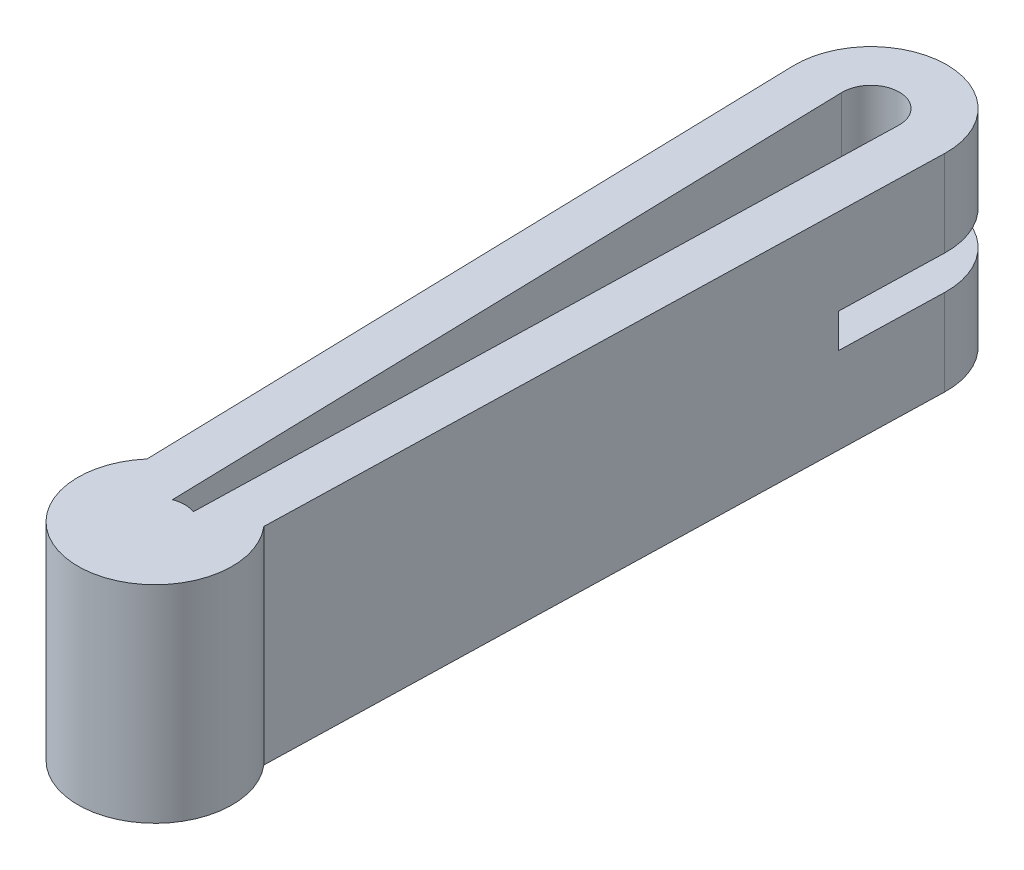
ISO-10303-21;
HEADER;
FILE_DESCRIPTION(('STEP AP214'),'2;1');
FILE_NAME('part.step','',(''),(''),'','','');
FILE_SCHEMA(('AUTOMOTIVE_DESIGN { 1 0 10303 214 1 1 1 1 }'));
ENDSEC;
DATA;
#1=APPLICATION_CONTEXT('core data for automotive mechanical design processes');
#2=APPLICATION_PROTOCOL_DEFINITION('international standard','automotive_design',2000,#1);
#3=PRODUCT_CONTEXT('',#1,'mechanical');
#4=PRODUCT('Part','Part','',(#3));
#5=PRODUCT_RELATED_PRODUCT_CATEGORY('part','',(#4));
#6=PRODUCT_DEFINITION_FORMATION('','',#4);
#7=PRODUCT_DEFINITION_CONTEXT('part definition',#1,'design');
#8=PRODUCT_DEFINITION('design','',#6,#7);
#9=PRODUCT_DEFINITION_SHAPE('','',#8);
#10=(LENGTH_UNIT() NAMED_UNIT(*) SI_UNIT(.MILLI.,.METRE.));
#11=(NAMED_UNIT(*) PLANE_ANGLE_UNIT() SI_UNIT($,.RADIAN.));
#12=(NAMED_UNIT(*) SI_UNIT($,.STERADIAN.) SOLID_ANGLE_UNIT());
#13=UNCERTAINTY_MEASURE_WITH_UNIT(LENGTH_MEASURE(1.E-05),#10,'distance_accuracy_value','');
#14=(GEOMETRIC_REPRESENTATION_CONTEXT(3) GLOBAL_UNCERTAINTY_ASSIGNED_CONTEXT((#13)) GLOBAL_UNIT_ASSIGNED_CONTEXT((#10,
#11,#12)) REPRESENTATION_CONTEXT('',''));
#15=CARTESIAN_POINT('',(0.,0.,0.));
#16=DIRECTION('',(0.,0.,1.));
#17=DIRECTION('',(1.,0.,0.));
#18=AXIS2_PLACEMENT_3D('',#15,#16,#17);
#19=CARTESIAN_POINT('',(0.,0.,14.108957794808));
#20=DIRECTION('',(0.,0.,-1.));
#21=DIRECTION('',(-1.,0.,0.));
#22=AXIS2_PLACEMENT_3D('',#19,#20,#21);
#23=PLANE('',#22);
#24=DIRECTION('',(0.,-1.,0.));
#25=VECTOR('',#24,1.);
#26=CARTESIAN_POINT('',(3.4418499771524,0.,14.108957794808));
#27=LINE('',#26,#25);
#28=CARTESIAN_POINT('',(3.4418499771524,16.129,14.108957794808));
#29=VERTEX_POINT('',#28);
#30=CARTESIAN_POINT('',(3.4418499771524,11.557,14.108957794808));
#31=VERTEX_POINT('',#30);
#32=EDGE_CURVE('E42',#29,#31,#27,.T.);
#33=ORIENTED_EDGE('',*,*,#32,.F.);
#34=DIRECTION('',(1.,0.,0.));
#35=VECTOR('',#34,1.);
#36=CARTESIAN_POINT('',(13.8535163071794,16.129,14.108957794808));
#37=LINE('',#36,#35);
#38=CARTESIAN_POINT('',(9.79402670946941,16.129,14.108957794808));
#39=VERTEX_POINT('',#38);
#40=EDGE_CURVE('E206',#29,#39,#37,.T.);
#41=ORIENTED_EDGE('',*,*,#40,.T.);
#42=DIRECTION('',(0.,1.,0.));
#43=VECTOR('',#42,1.);
#44=CARTESIAN_POINT('',(9.79402670946941,27.686,14.108957794808));
#45=LINE('',#44,#43);
#46=CARTESIAN_POINT('',(9.79402670946941,11.557,14.108957794808));
#47=VERTEX_POINT('',#46);
#48=EDGE_CURVE('E258',#47,#39,#45,.T.);
#49=ORIENTED_EDGE('',*,*,#48,.F.);
#50=DIRECTION('',(-1.,0.,0.));
#51=VECTOR('',#50,1.);
#52=CARTESIAN_POINT('',(13.8535163071794,11.557,14.108957794808));
#53=LINE('',#52,#51);
#54=EDGE_CURVE('E203',#47,#31,#53,.T.);
#55=ORIENTED_EDGE('',*,*,#54,.T.);
#56=EDGE_LOOP('',(#33,#41,#49,#55));
#57=FACE_BOUND('',#56,.T.);
#58=ADVANCED_FACE('F34',(#57),#23,.T.);
#59=CARTESIAN_POINT('',(0.,27.686,0.));
#60=DIRECTION('',(0.,-1.,0.));
#61=DIRECTION('',(0.,0.,-1.));
#62=AXIS2_PLACEMENT_3D('',#59,#60,#61);
#63=CYLINDRICAL_SURFACE('',#62,10.16);
#64=DIRECTION('',(0.,-1.,0.));
#65=VECTOR('',#64,1.);
#66=CARTESIAN_POINT('',(10.1565184217517,27.686,0.265957794807991));
#67=LINE('',#66,#65);
#68=CARTESIAN_POINT('',(10.1565184217517,27.686,0.265957794807991));
#69=VERTEX_POINT('',#68);
#70=CARTESIAN_POINT('',(10.1565184217517,16.129,0.265957794807991));
#71=VERTEX_POINT('',#70);
#72=EDGE_CURVE('E246',#69,#71,#67,.T.);
#73=ORIENTED_EDGE('',*,*,#72,.T.);
#74=CARTESIAN_POINT('',(0.,16.129,0.));
#75=DIRECTION('',(0.,1.,0.));
#76=DIRECTION('',(0.,0.,1.));
#77=AXIS2_PLACEMENT_3D('',#74,#75,#76);
#78=CIRCLE('',#77,10.16);
#79=CARTESIAN_POINT('',(-10.1565184217517,16.129,0.265957794807996));
#80=VERTEX_POINT('',#79);
#81=EDGE_CURVE('E218',#71,#80,#78,.T.);
#82=ORIENTED_EDGE('',*,*,#81,.T.);
#83=DIRECTION('',(0.,-1.,0.));
#84=VECTOR('',#83,1.);
#85=CARTESIAN_POINT('',(-10.1565184217517,27.686,0.265957794807996));
#86=LINE('',#85,#84);
#87=CARTESIAN_POINT('',(-10.1565184217517,27.686,0.265957794807996));
#88=VERTEX_POINT('',#87);
#89=EDGE_CURVE('E255',#88,#80,#86,.T.);
#90=ORIENTED_EDGE('',*,*,#89,.F.);
#91=CARTESIAN_POINT('',(0.,27.686,0.));
#92=DIRECTION('',(0.,1.,0.));
#93=DIRECTION('',(0.,0.,1.));
#94=AXIS2_PLACEMENT_3D('',#91,#92,#93);
#95=CIRCLE('',#94,10.16);
#96=EDGE_CURVE('E225',#69,#88,#95,.T.);
#97=ORIENTED_EDGE('',*,*,#96,.F.);
#98=EDGE_LOOP('',(#73,#82,#90,#97));
#99=FACE_BOUND('',#98,.T.);
#100=ADVANCED_FACE('F302',(#99),#63,.T.);
#101=CARTESIAN_POINT('',(-10.1565184217517,11.557,0.265957794807996));
#102=VERTEX_POINT('',#101);
#103=CARTESIAN_POINT('',(-10.1565184217517,0.,0.265957794807996));
#104=VERTEX_POINT('',#103);
#105=EDGE_CURVE('E254',#102,#104,#86,.T.);
#106=ORIENTED_EDGE('',*,*,#105,.F.);
#107=CARTESIAN_POINT('',(0.,11.557,0.));
#108=DIRECTION('',(0.,-1.,0.));
#109=DIRECTION('',(0.,0.,-1.));
#110=AXIS2_PLACEMENT_3D('',#107,#108,#109);
#111=CIRCLE('',#110,10.16);
#112=CARTESIAN_POINT('',(10.1565184217517,11.557,0.265957794807991));
#113=VERTEX_POINT('',#112);
#114=EDGE_CURVE('E212',#102,#113,#111,.T.);
#115=ORIENTED_EDGE('',*,*,#114,.T.);
#116=CARTESIAN_POINT('',(10.1565184217517,0.,0.265957794807991));
#117=VERTEX_POINT('',#116);
#118=EDGE_CURVE('E236',#113,#117,#67,.T.);
#119=ORIENTED_EDGE('',*,*,#118,.T.);
#120=CARTESIAN_POINT('',(0.,0.,0.));
#121=DIRECTION('',(0.,1.,0.));
#122=DIRECTION('',(0.,0.,1.));
#123=AXIS2_PLACEMENT_3D('',#120,#121,#122);
#124=CIRCLE('',#123,10.16);
#125=EDGE_CURVE('E224',#117,#104,#124,.T.);
#126=ORIENTED_EDGE('',*,*,#125,.T.);
#127=EDGE_LOOP('',(#106,#115,#119,#126));
#128=FACE_BOUND('',#127,.T.);
#129=ADVANCED_FACE('F36',(#128),#63,.T.);
#130=CARTESIAN_POINT('',(-10.1565184217517,27.686,0.265957794807996));
#131=DIRECTION('',(0.999657324975557,0.,-0.0261769483078737));
#132=DIRECTION('',(-0.0261769483078737,0.,-0.999657324975557));
#133=AXIS2_PLACEMENT_3D('',#130,#131,#132);
#134=PLANE('',#133);
#135=ORIENTED_EDGE('',*,*,#89,.T.);
#136=DIRECTION('',(0.0261769483078737,0.,0.999657324975557));
#137=VECTOR('',#136,1.);
#138=CARTESIAN_POINT('',(-10.1565184217517,16.129,0.265957794807996));
#139=LINE('',#138,#137);
#140=CARTESIAN_POINT('',(-9.79402670946939,16.129,14.108957794808));
#141=VERTEX_POINT('',#140);
#142=EDGE_CURVE('E221',#80,#141,#139,.T.);
#143=ORIENTED_EDGE('',*,*,#142,.T.);
#144=DIRECTION('',(0.,1.,0.));
#145=VECTOR('',#144,1.);
#146=CARTESIAN_POINT('',(-9.7940267094694,27.686,14.108957794808));
#147=LINE('',#146,#145);
#148=CARTESIAN_POINT('',(-9.79402670946939,11.557,14.108957794808));
#149=VERTEX_POINT('',#148);
#150=EDGE_CURVE('E210',#149,#141,#147,.T.);
#151=ORIENTED_EDGE('',*,*,#150,.F.);
#152=DIRECTION('',(-0.0261769483078737,0.,-0.999657324975557));
#153=VECTOR('',#152,1.);
#154=CARTESIAN_POINT('',(-10.1565184217517,11.557,0.265957794807996));
#155=LINE('',#154,#153);
#156=EDGE_CURVE('E215',#149,#102,#155,.T.);
#157=ORIENTED_EDGE('',*,*,#156,.T.);
#158=ORIENTED_EDGE('',*,*,#105,.T.);
#159=DIRECTION('',(0.0261769483078737,0.,0.999657324975557));
#160=VECTOR('',#159,1.);
#161=CARTESIAN_POINT('',(-10.1565184217517,0.,0.265957794807996));
#162=LINE('',#161,#160);
#163=CARTESIAN_POINT('',(-7.8285899942509,0.,89.165957794808));
#164=VERTEX_POINT('',#163);
#165=EDGE_CURVE('E239',#104,#164,#162,.T.);
#166=ORIENTED_EDGE('',*,*,#165,.T.);
#167=DIRECTION('',(0.,-1.,0.));
#168=VECTOR('',#167,1.);
#169=CARTESIAN_POINT('',(-7.8285899942509,27.686,89.165957794808));
#170=LINE('',#169,#168);
#171=CARTESIAN_POINT('',(-7.8285899942509,27.686,89.165957794808));
#172=VERTEX_POINT('',#171);
#173=EDGE_CURVE('E251',#172,#164,#170,.T.);
#174=ORIENTED_EDGE('',*,*,#173,.F.);
#175=DIRECTION('',(0.0261769483078737,0.,0.999657324975557));
#176=VECTOR('',#175,1.);
#177=CARTESIAN_POINT('',(-10.1565184217517,27.686,0.265957794807996));
#178=LINE('',#177,#176);
#179=EDGE_CURVE('E228',#88,#172,#178,.T.);
#180=ORIENTED_EDGE('',*,*,#179,.F.);
#181=EDGE_LOOP('',(#135,#143,#151,#157,#158,#166,#174,#180));
#182=FACE_BOUND('',#181,.T.);
#183=ADVANCED_FACE('F288',(#182),#134,.F.);
#184=CARTESIAN_POINT('',(0.,27.686,95.9115488930455));
#185=DIRECTION('',(0.,-1.,0.));
#186=DIRECTION('',(0.,0.,-1.));
#187=AXIS2_PLACEMENT_3D('',#184,#185,#186);
#188=CYLINDRICAL_SURFACE('',#187,10.3339160323039);
#189=CARTESIAN_POINT('',(0.,0.,95.9115488930455));
#190=DIRECTION('',(0.,1.,0.));
#191=DIRECTION('',(0.,0.,1.));
#192=AXIS2_PLACEMENT_3D('',#189,#190,#191);
#193=CIRCLE('',#192,10.3339160323039);
#194=CARTESIAN_POINT('',(7.82858999425095,0.,89.165957794808));
#195=VERTEX_POINT('',#194);
#196=EDGE_CURVE('E241',#164,#195,#193,.T.);
#197=ORIENTED_EDGE('',*,*,#196,.T.);
#198=DIRECTION('',(0.,-1.,0.));
#199=VECTOR('',#198,1.);
#200=CARTESIAN_POINT('',(7.82858999425095,27.686,89.165957794808));
#201=LINE('',#200,#199);
#202=CARTESIAN_POINT('',(7.82858999425095,27.686,89.165957794808));
#203=VERTEX_POINT('',#202);
#204=EDGE_CURVE('E249',#203,#195,#201,.T.);
#205=ORIENTED_EDGE('',*,*,#204,.F.);
#206=CARTESIAN_POINT('',(0.,27.686,95.9115488930455));
#207=DIRECTION('',(0.,1.,0.));
#208=DIRECTION('',(0.,0.,1.));
#209=AXIS2_PLACEMENT_3D('',#206,#207,#208);
#210=CIRCLE('',#209,10.3339160323039);
#211=EDGE_CURVE('E231',#172,#203,#210,.T.);
#212=ORIENTED_EDGE('',*,*,#211,.F.);
#213=ORIENTED_EDGE('',*,*,#173,.T.);
#214=EDGE_LOOP('',(#197,#205,#212,#213));
#215=FACE_BOUND('',#214,.T.);
#216=ADVANCED_FACE('F296',(#215),#188,.T.);
#217=CARTESIAN_POINT('',(10.1565184217517,27.686,0.265957794807991));
#218=DIRECTION('',(0.999657324975557,0.,0.0261769483078731));
#219=DIRECTION('',(0.0261769483078731,0.,-0.999657324975557));
#220=AXIS2_PLACEMENT_3D('',#217,#218,#219);
#221=PLANE('',#220);
#222=DIRECTION('',(-0.0261769483078731,0.,0.999657324975557));
#223=VECTOR('',#222,1.);
#224=CARTESIAN_POINT('',(10.1565184217517,16.129,0.265957794807991));
#225=LINE('',#224,#223);
#226=EDGE_CURVE('E263',#71,#39,#225,.T.);
#227=ORIENTED_EDGE('',*,*,#226,.F.);
#228=ORIENTED_EDGE('',*,*,#72,.F.);
#229=DIRECTION('',(-0.0261769483078731,0.,0.999657324975557));
#230=VECTOR('',#229,1.);
#231=CARTESIAN_POINT('',(10.1565184217517,27.686,0.265957794807991));
#232=LINE('',#231,#230);
#233=EDGE_CURVE('E233',#69,#203,#232,.T.);
#234=ORIENTED_EDGE('',*,*,#233,.T.);
#235=ORIENTED_EDGE('',*,*,#204,.T.);
#236=DIRECTION('',(-0.0261769483078731,0.,0.999657324975557));
#237=VECTOR('',#236,1.);
#238=CARTESIAN_POINT('',(10.1565184217517,0.,0.265957794807991));
#239=LINE('',#238,#237);
#240=EDGE_CURVE('E229',#117,#195,#239,.T.);
#241=ORIENTED_EDGE('',*,*,#240,.F.);
#242=ORIENTED_EDGE('',*,*,#118,.F.);
#243=DIRECTION('',(0.0261769483078731,0.,-0.999657324975557));
#244=VECTOR('',#243,1.);
#245=CARTESIAN_POINT('',(10.1565184217517,11.557,0.265957794807991));
#246=LINE('',#245,#244);
#247=EDGE_CURVE('E261',#47,#113,#246,.T.);
#248=ORIENTED_EDGE('',*,*,#247,.F.);
#249=ORIENTED_EDGE('',*,*,#48,.T.);
#250=EDGE_LOOP('',(#227,#228,#234,#235,#241,#242,#248,#249));
#251=FACE_BOUND('',#250,.T.);
#252=ADVANCED_FACE('F279',(#251),#221,.T.);
#253=CARTESIAN_POINT('',(0.,27.686,0.));
#254=DIRECTION('',(0.,1.,0.));
#255=DIRECTION('',(0.,0.,1.));
#256=AXIS2_PLACEMENT_3D('',#253,#254,#255);
#257=PLANE('',#256);
#258=CARTESIAN_POINT('',(0.,27.686,95.9115488930455));
#259=DIRECTION('',(0.,1.,0.));
#260=DIRECTION('',(0.,0.,-1.));
#261=AXIS2_PLACEMENT_3D('',#258,#259,#260);
#262=CIRCLE('',#261,3.98391603230388);
#263=CARTESIAN_POINT('',(1.39746748710064,27.686,92.1807753037018));
#264=VERTEX_POINT('',#263);
#265=CARTESIAN_POINT('',(-1.39746748710058,27.686,92.1807753037018));
#266=VERTEX_POINT('',#265);
#267=EDGE_CURVE('E150',#264,#266,#262,.T.);
#268=ORIENTED_EDGE('',*,*,#267,.T.);
#269=DIRECTION('',(-0.0261769483078737,0.,-0.999657324975557));
#270=VECTOR('',#269,1.);
#271=CARTESIAN_POINT('',(-1.39746748710058,27.686,92.1807753037018));
#272=LINE('',#271,#270);
#273=CARTESIAN_POINT('',(-3.80869440815687,27.686,0.0997341730529965));
#274=VERTEX_POINT('',#273);
#275=EDGE_CURVE('E159',#266,#274,#272,.T.);
#276=ORIENTED_EDGE('',*,*,#275,.T.);
#277=CARTESIAN_POINT('',(0.,27.686,0.));
#278=DIRECTION('',(0.,-1.,0.));
#279=DIRECTION('',(0.,0.,-1.));
#280=AXIS2_PLACEMENT_3D('',#277,#278,#279);
#281=CIRCLE('',#280,3.81);
#282=CARTESIAN_POINT('',(3.80869440815687,27.686,0.0997341730529971));
#283=VERTEX_POINT('',#282);
#284=EDGE_CURVE('E49',#274,#283,#281,.T.);
#285=ORIENTED_EDGE('',*,*,#284,.T.);
#286=DIRECTION('',(-0.0261769483078731,0.,0.999657324975557));
#287=VECTOR('',#286,1.);
#288=CARTESIAN_POINT('',(3.80869440815687,27.686,0.0997341730529964));
#289=LINE('',#288,#287);
#290=EDGE_CURVE('E156',#283,#264,#289,.T.);
#291=ORIENTED_EDGE('',*,*,#290,.T.);
#292=EDGE_LOOP('',(#268,#276,#285,#291));
#293=FACE_BOUND('',#292,.T.);
#294=ORIENTED_EDGE('',*,*,#96,.T.);
#295=ORIENTED_EDGE('',*,*,#179,.T.);
#296=ORIENTED_EDGE('',*,*,#211,.T.);
#297=ORIENTED_EDGE('',*,*,#233,.F.);
#298=EDGE_LOOP('',(#294,#295,#296,#297));
#299=FACE_BOUND('',#298,.T.);
#300=ADVANCED_FACE('F164',(#293,#299),#257,.T.);
#301=CARTESIAN_POINT('',(0.,0.,0.));
#302=DIRECTION('',(0.,1.,0.));
#303=DIRECTION('',(0.,0.,1.));
#304=AXIS2_PLACEMENT_3D('',#301,#302,#303);
#305=PLANE('',#304);
#306=DIRECTION('',(-0.0261769483078737,0.,-0.999657324975557));
#307=VECTOR('',#306,1.);
#308=CARTESIAN_POINT('',(-1.39746748710058,0.,92.1807753037018));
#309=LINE('',#308,#307);
#310=CARTESIAN_POINT('',(-1.39746748710058,0.,92.1807753037018));
#311=VERTEX_POINT('',#310);
#312=CARTESIAN_POINT('',(-3.80869440815687,0.,0.0997341730529965));
#313=VERTEX_POINT('',#312);
#314=EDGE_CURVE('E176',#311,#313,#309,.T.);
#315=ORIENTED_EDGE('',*,*,#314,.F.);
#316=CARTESIAN_POINT('',(0.,0.,95.9115488930455));
#317=DIRECTION('',(0.,1.,0.));
#318=DIRECTION('',(0.,0.,-1.));
#319=AXIS2_PLACEMENT_3D('',#316,#317,#318);
#320=CIRCLE('',#319,3.98391603230388);
#321=CARTESIAN_POINT('',(1.39746748710064,0.,92.1807753037018));
#322=VERTEX_POINT('',#321);
#323=EDGE_CURVE('E57',#322,#311,#320,.T.);
#324=ORIENTED_EDGE('',*,*,#323,.F.);
#325=DIRECTION('',(-0.0261769483078731,0.,0.999657324975557));
#326=VECTOR('',#325,1.);
#327=CARTESIAN_POINT('',(3.80869440815687,0.,0.0997341730529964));
#328=LINE('',#327,#326);
#329=CARTESIAN_POINT('',(3.80869440815687,0.,0.0997341730529971));
#330=VERTEX_POINT('',#329);
#331=EDGE_CURVE('E167',#330,#322,#328,.T.);
#332=ORIENTED_EDGE('',*,*,#331,.F.);
#333=CARTESIAN_POINT('',(0.,0.,0.));
#334=DIRECTION('',(0.,-1.,0.));
#335=DIRECTION('',(0.,0.,-1.));
#336=AXIS2_PLACEMENT_3D('',#333,#334,#335);
#337=CIRCLE('',#336,3.81);
#338=EDGE_CURVE('E170',#313,#330,#337,.T.);
#339=ORIENTED_EDGE('',*,*,#338,.F.);
#340=EDGE_LOOP('',(#315,#324,#332,#339));
#341=FACE_BOUND('',#340,.T.);
#342=ORIENTED_EDGE('',*,*,#125,.F.);
#343=ORIENTED_EDGE('',*,*,#240,.T.);
#344=ORIENTED_EDGE('',*,*,#196,.F.);
#345=ORIENTED_EDGE('',*,*,#165,.F.);
#346=EDGE_LOOP('',(#342,#343,#344,#345));
#347=FACE_BOUND('',#346,.T.);
#348=ADVANCED_FACE('F293',(#341,#347),#305,.F.);
#349=CARTESIAN_POINT('',(13.8535163071794,16.129,14.108957794808));
#350=DIRECTION('',(0.,1.,0.));
#351=DIRECTION('',(0.,0.,1.));
#352=AXIS2_PLACEMENT_3D('',#349,#350,#351);
#353=PLANE('',#352);
#354=ORIENTED_EDGE('',*,*,#40,.F.);
#355=DIRECTION('',(0.0261769483078731,0.,-0.999657324975557));
#356=VECTOR('',#355,1.);
#357=CARTESIAN_POINT('',(3.44898439057854,16.129,13.8365055380758));
#358=LINE('',#357,#356);
#359=CARTESIAN_POINT('',(3.80869440815687,16.129,0.0997341730529971));
#360=VERTEX_POINT('',#359);
#361=EDGE_CURVE('E196',#29,#360,#358,.T.);
#362=ORIENTED_EDGE('',*,*,#361,.T.);
#363=CARTESIAN_POINT('',(0.,16.129,0.));
#364=DIRECTION('',(0.,1.,0.));
#365=DIRECTION('',(0.,0.,1.));
#366=AXIS2_PLACEMENT_3D('',#363,#364,#365);
#367=CIRCLE('',#366,3.81);
#368=CARTESIAN_POINT('',(-3.80869440815687,16.129,0.0997341730529965));
#369=VERTEX_POINT('',#368);
#370=EDGE_CURVE('E199',#360,#369,#367,.T.);
#371=ORIENTED_EDGE('',*,*,#370,.T.);
#372=DIRECTION('',(0.0261769483078737,0.,0.999657324975557));
#373=VECTOR('',#372,1.);
#374=CARTESIAN_POINT('',(-3.42999862795259,16.129,14.5615425613392));
#375=LINE('',#374,#373);
#376=CARTESIAN_POINT('',(-3.44184997715239,16.129,14.108957794808));
#377=VERTEX_POINT('',#376);
#378=EDGE_CURVE('E190',#369,#377,#375,.T.);
#379=ORIENTED_EDGE('',*,*,#378,.T.);
#380=EDGE_CURVE('E207',#141,#377,#37,.T.);
#381=ORIENTED_EDGE('',*,*,#380,.F.);
#382=ORIENTED_EDGE('',*,*,#142,.F.);
#383=ORIENTED_EDGE('',*,*,#81,.F.);
#384=ORIENTED_EDGE('',*,*,#226,.T.);
#385=EDGE_LOOP('',(#354,#362,#371,#379,#381,#382,#383,#384));
#386=FACE_BOUND('',#385,.T.);
#387=ADVANCED_FACE('F304',(#386),#353,.F.);
#388=CARTESIAN_POINT('',(13.8535163071794,11.557,14.108957794808));
#389=DIRECTION('',(0.,-1.,0.));
#390=DIRECTION('',(0.,0.,-1.));
#391=AXIS2_PLACEMENT_3D('',#388,#389,#390);
#392=PLANE('',#391);
#393=CARTESIAN_POINT('',(0.,11.557,0.));
#394=DIRECTION('',(0.,-1.,0.));
#395=DIRECTION('',(0.,0.,-1.));
#396=AXIS2_PLACEMENT_3D('',#393,#394,#395);
#397=CIRCLE('',#396,3.81);
#398=CARTESIAN_POINT('',(-3.80869440815687,11.557,0.0997341730529965));
#399=VERTEX_POINT('',#398);
#400=CARTESIAN_POINT('',(3.80869440815687,11.557,0.0997341730529971));
#401=VERTEX_POINT('',#400);
#402=EDGE_CURVE('E12',#399,#401,#397,.T.);
#403=ORIENTED_EDGE('',*,*,#402,.T.);
#404=DIRECTION('',(-0.0261769483078731,0.,0.999657324975557));
#405=VECTOR('',#404,1.);
#406=CARTESIAN_POINT('',(3.44898439057854,11.557,13.8365055380758));
#407=LINE('',#406,#405);
#408=EDGE_CURVE('E193',#401,#31,#407,.T.);
#409=ORIENTED_EDGE('',*,*,#408,.T.);
#410=ORIENTED_EDGE('',*,*,#54,.F.);
#411=ORIENTED_EDGE('',*,*,#247,.T.);
#412=ORIENTED_EDGE('',*,*,#114,.F.);
#413=ORIENTED_EDGE('',*,*,#156,.F.);
#414=CARTESIAN_POINT('',(-3.44184997715238,11.557,14.108957794808));
#415=VERTEX_POINT('',#414);
#416=EDGE_CURVE('E202',#415,#149,#53,.T.);
#417=ORIENTED_EDGE('',*,*,#416,.F.);
#418=DIRECTION('',(-0.0261769483078737,0.,-0.999657324975557));
#419=VECTOR('',#418,1.);
#420=CARTESIAN_POINT('',(-3.42999862795259,11.557,14.5615425613392));
#421=LINE('',#420,#419);
#422=EDGE_CURVE('E182',#415,#399,#421,.T.);
#423=ORIENTED_EDGE('',*,*,#422,.T.);
#424=EDGE_LOOP('',(#403,#409,#410,#411,#412,#413,#417,#423));
#425=FACE_BOUND('',#424,.T.);
#426=ADVANCED_FACE('F275',(#425),#392,.F.);
#427=DIRECTION('',(0.,1.,0.));
#428=VECTOR('',#427,1.);
#429=CARTESIAN_POINT('',(-3.44184997715239,0.,14.108957794808));
#430=LINE('',#429,#428);
#431=EDGE_CURVE('E266',#415,#377,#430,.T.);
#432=ORIENTED_EDGE('',*,*,#431,.F.);
#433=ORIENTED_EDGE('',*,*,#416,.T.);
#434=ORIENTED_EDGE('',*,*,#150,.T.);
#435=ORIENTED_EDGE('',*,*,#380,.T.);
#436=EDGE_LOOP('',(#432,#433,#434,#435));
#437=FACE_BOUND('',#436,.T.);
#438=ADVANCED_FACE('F308',(#437),#23,.T.);
#439=CARTESIAN_POINT('',(0.,27.686,0.));
#440=DIRECTION('',(0.,-1.,0.));
#441=DIRECTION('',(0.,0.,-1.));
#442=AXIS2_PLACEMENT_3D('',#439,#440,#441);
#443=CYLINDRICAL_SURFACE('',#442,3.81);
#444=DIRECTION('',(0.,-1.,0.));
#445=VECTOR('',#444,1.);
#446=CARTESIAN_POINT('',(3.80869440815687,27.686,0.0997341730529971));
#447=LINE('',#446,#445);
#448=EDGE_CURVE('E183',#283,#360,#447,.T.);
#449=ORIENTED_EDGE('',*,*,#448,.F.);
#450=ORIENTED_EDGE('',*,*,#284,.F.);
#451=DIRECTION('',(0.,-1.,0.));
#452=VECTOR('',#451,1.);
#453=CARTESIAN_POINT('',(-3.80869440815687,27.686,0.0997341730529965));
#454=LINE('',#453,#452);
#455=EDGE_CURVE('E161',#274,#369,#454,.T.);
#456=ORIENTED_EDGE('',*,*,#455,.T.);
#457=ORIENTED_EDGE('',*,*,#370,.F.);
#458=EDGE_LOOP('',(#449,#450,#456,#457));
#459=FACE_BOUND('',#458,.T.);
#460=ADVANCED_FACE('F332',(#459),#443,.F.);
#461=EDGE_CURVE('E155',#399,#313,#454,.T.);
#462=ORIENTED_EDGE('',*,*,#461,.T.);
#463=ORIENTED_EDGE('',*,*,#338,.T.);
#464=EDGE_CURVE('E186',#401,#330,#447,.T.);
#465=ORIENTED_EDGE('',*,*,#464,.F.);
#466=ORIENTED_EDGE('',*,*,#402,.F.);
#467=EDGE_LOOP('',(#462,#463,#465,#466));
#468=FACE_BOUND('',#467,.T.);
#469=ADVANCED_FACE('F313',(#468),#443,.F.);
#470=CARTESIAN_POINT('',(3.80869440815687,27.686,0.0997341730529964));
#471=DIRECTION('',(0.999657324975557,0.,0.0261769483078731));
#472=DIRECTION('',(0.0261769483078731,0.,-0.999657324975557));
#473=AXIS2_PLACEMENT_3D('',#470,#471,#472);
#474=PLANE('',#473);
#475=ORIENTED_EDGE('',*,*,#32,.T.);
#476=ORIENTED_EDGE('',*,*,#408,.F.);
#477=ORIENTED_EDGE('',*,*,#464,.T.);
#478=ORIENTED_EDGE('',*,*,#331,.T.);
#479=DIRECTION('',(0.,-1.,0.));
#480=VECTOR('',#479,1.);
#481=CARTESIAN_POINT('',(1.39746748710064,27.686,92.1807753037018));
#482=LINE('',#481,#480);
#483=EDGE_CURVE('E180',#264,#322,#482,.T.);
#484=ORIENTED_EDGE('',*,*,#483,.F.);
#485=ORIENTED_EDGE('',*,*,#290,.F.);
#486=ORIENTED_EDGE('',*,*,#448,.T.);
#487=ORIENTED_EDGE('',*,*,#361,.F.);
#488=EDGE_LOOP('',(#475,#476,#477,#478,#484,#485,#486,#487));
#489=FACE_BOUND('',#488,.T.);
#490=ADVANCED_FACE('F269',(#489),#474,.F.);
#491=CARTESIAN_POINT('',(-1.39746748710058,27.686,92.1807753037018));
#492=DIRECTION('',(-0.999657324975557,0.,0.0261769483078736));
#493=DIRECTION('',(0.0261769483078737,0.,0.999657324975557));
#494=AXIS2_PLACEMENT_3D('',#491,#492,#493);
#495=PLANE('',#494);
#496=ORIENTED_EDGE('',*,*,#455,.F.);
#497=ORIENTED_EDGE('',*,*,#275,.F.);
#498=DIRECTION('',(0.,-1.,0.));
#499=VECTOR('',#498,1.);
#500=CARTESIAN_POINT('',(-1.39746748710058,27.686,92.1807753037018));
#501=LINE('',#500,#499);
#502=EDGE_CURVE('E146',#266,#311,#501,.T.);
#503=ORIENTED_EDGE('',*,*,#502,.T.);
#504=ORIENTED_EDGE('',*,*,#314,.T.);
#505=ORIENTED_EDGE('',*,*,#461,.F.);
#506=ORIENTED_EDGE('',*,*,#422,.F.);
#507=ORIENTED_EDGE('',*,*,#431,.T.);
#508=ORIENTED_EDGE('',*,*,#378,.F.);
#509=EDGE_LOOP('',(#496,#497,#503,#504,#505,#506,#507,#508));
#510=FACE_BOUND('',#509,.T.);
#511=ADVANCED_FACE('F160',(#510),#495,.F.);
#512=CARTESIAN_POINT('',(0.,27.686,95.9115488930455));
#513=DIRECTION('',(0.,-1.,0.));
#514=DIRECTION('',(0.,0.,-1.));
#515=AXIS2_PLACEMENT_3D('',#512,#513,#514);
#516=CYLINDRICAL_SURFACE('',#515,3.98391603230388);
#517=ORIENTED_EDGE('',*,*,#323,.T.);
#518=ORIENTED_EDGE('',*,*,#502,.F.);
#519=ORIENTED_EDGE('',*,*,#267,.F.);
#520=ORIENTED_EDGE('',*,*,#483,.T.);
#521=EDGE_LOOP('',(#517,#518,#519,#520));
#522=FACE_BOUND('',#521,.T.);
#523=ADVANCED_FACE('F148',(#522),#516,.T.);
#524=CLOSED_SHELL('',(#58,#100,#129,#183,#216,#252,#300,#348,#387,#426,#438,#460,#469,#490,#511,#523));
#525=MANIFOLD_SOLID_BREP('B2',#524);
#526=ADVANCED_BREP_SHAPE_REPRESENTATION('',(#18,#525),#14);
#527=SHAPE_DEFINITION_REPRESENTATION(#9,#526);
ENDSEC;
END-ISO-10303-21;
